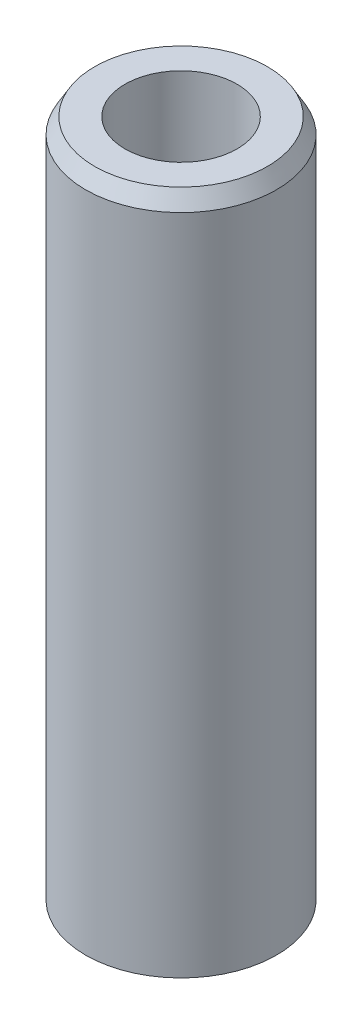
ISO-10303-21;
HEADER;
FILE_DESCRIPTION(('STEP AP214'),'2;1');
FILE_NAME('part.step','',(''),(''),'','','');
FILE_SCHEMA(('AUTOMOTIVE_DESIGN { 1 0 10303 214 1 1 1 1 }'));
ENDSEC;
DATA;
#1=APPLICATION_CONTEXT('core data for automotive mechanical design processes');
#2=APPLICATION_PROTOCOL_DEFINITION('international standard','automotive_design',2000,#1);
#3=PRODUCT_CONTEXT('',#1,'mechanical');
#4=PRODUCT('Part','Part','',(#3));
#5=PRODUCT_RELATED_PRODUCT_CATEGORY('part','',(#4));
#6=PRODUCT_DEFINITION_FORMATION('','',#4);
#7=PRODUCT_DEFINITION_CONTEXT('part definition',#1,'design');
#8=PRODUCT_DEFINITION('design','',#6,#7);
#9=PRODUCT_DEFINITION_SHAPE('','',#8);
#10=(LENGTH_UNIT() NAMED_UNIT(*) SI_UNIT(.MILLI.,.METRE.));
#11=(NAMED_UNIT(*) PLANE_ANGLE_UNIT() SI_UNIT($,.RADIAN.));
#12=(NAMED_UNIT(*) SI_UNIT($,.STERADIAN.) SOLID_ANGLE_UNIT());
#13=UNCERTAINTY_MEASURE_WITH_UNIT(LENGTH_MEASURE(1.E-05),#10,'distance_accuracy_value','');
#14=(GEOMETRIC_REPRESENTATION_CONTEXT(3) GLOBAL_UNCERTAINTY_ASSIGNED_CONTEXT((#13)) GLOBAL_UNIT_ASSIGNED_CONTEXT((#10,
#11,#12)) REPRESENTATION_CONTEXT('',''));
#15=CARTESIAN_POINT('',(0.,0.,0.));
#16=DIRECTION('',(0.,0.,1.));
#17=DIRECTION('',(1.,0.,0.));
#18=AXIS2_PLACEMENT_3D('',#15,#16,#17);
#19=CARTESIAN_POINT('',(0.,144.007816755251,0.));
#20=DIRECTION('',(0.,-1.,0.));
#21=DIRECTION('',(0.,0.,-1.));
#22=AXIS2_PLACEMENT_3D('',#19,#20,#21);
#23=CYLINDRICAL_SURFACE('',#22,20.);
#24=CARTESIAN_POINT('',(0.,140.72305377508,0.));
#25=DIRECTION('',(0.,1.,0.));
#26=DIRECTION('',(0.,0.,1.));
#27=AXIS2_PLACEMENT_3D('',#24,#25,#26);
#28=CIRCLE('',#27,20.);
#29=CARTESIAN_POINT('',(0.,140.72305377508,20.));
#30=VERTEX_POINT('',#29);
#31=EDGE_CURVE('E50',#30,#30,#28,.F.);
#32=ORIENTED_EDGE('',*,*,#31,.T.);
#33=EDGE_LOOP('',(#32));
#34=FACE_BOUND('',#33,.T.);
#35=CARTESIAN_POINT('',(0.,1.89645879082584,0.));
#36=DIRECTION('',(0.,1.,0.));
#37=DIRECTION('',(0.,0.,1.));
#38=AXIS2_PLACEMENT_3D('',#35,#36,#37);
#39=CIRCLE('',#38,20.);
#40=CARTESIAN_POINT('',(0.,1.89645879082584,20.));
#41=VERTEX_POINT('',#40);
#42=EDGE_CURVE('E51',#41,#41,#39,.T.);
#43=ORIENTED_EDGE('',*,*,#42,.T.);
#44=EDGE_LOOP('',(#43));
#45=FACE_BOUND('',#44,.T.);
#46=ADVANCED_FACE('F39',(#34,#45),#23,.T.);
#47=CARTESIAN_POINT('',(0.,144.007816755251,0.));
#48=DIRECTION('',(0.,1.,0.));
#49=DIRECTION('',(0.,0.,1.));
#50=AXIS2_PLACEMENT_3D('',#47,#48,#49);
#51=PLANE('',#50);
#52=CARTESIAN_POINT('',(0.,144.007816755251,0.));
#53=DIRECTION('',(0.,1.,0.));
#54=DIRECTION('',(0.,0.,1.));
#55=AXIS2_PLACEMENT_3D('',#52,#53,#54);
#56=CIRCLE('',#55,18.1035412091742);
#57=CARTESIAN_POINT('',(0.,144.007816755251,18.1035412091742));
#58=VERTEX_POINT('',#57);
#59=EDGE_CURVE('E54',#58,#58,#56,.T.);
#60=ORIENTED_EDGE('',*,*,#59,.T.);
#61=EDGE_LOOP('',(#60));
#62=FACE_BOUND('',#61,.T.);
#63=CARTESIAN_POINT('',(0.,144.007816755251,0.));
#64=DIRECTION('',(0.,1.,0.));
#65=DIRECTION('',(0.,0.,1.));
#66=AXIS2_PLACEMENT_3D('',#63,#64,#65);
#67=CIRCLE('',#66,11.7461129049412);
#68=CARTESIAN_POINT('',(0.,144.007816755251,11.7461129049412));
#69=VERTEX_POINT('',#68);
#70=EDGE_CURVE('E58',#69,#69,#67,.T.);
#71=ORIENTED_EDGE('',*,*,#70,.F.);
#72=EDGE_LOOP('',(#71));
#73=FACE_BOUND('',#72,.T.);
#74=ADVANCED_FACE('F69',(#62,#73),#51,.T.);
#75=CARTESIAN_POINT('',(0.,0.,0.));
#76=DIRECTION('',(0.,1.,0.));
#77=DIRECTION('',(0.,0.,1.));
#78=AXIS2_PLACEMENT_3D('',#75,#76,#77);
#79=PLANE('',#78);
#80=CARTESIAN_POINT('',(0.,0.,0.));
#81=DIRECTION('',(0.,1.,0.));
#82=DIRECTION('',(0.,0.,1.));
#83=AXIS2_PLACEMENT_3D('',#80,#81,#82);
#84=CIRCLE('',#83,16.715237019829);
#85=CARTESIAN_POINT('',(0.,0.,16.715237019829));
#86=VERTEX_POINT('',#85);
#87=EDGE_CURVE('E10',#86,#86,#84,.F.);
#88=ORIENTED_EDGE('',*,*,#87,.T.);
#89=EDGE_LOOP('',(#88));
#90=FACE_BOUND('',#89,.T.);
#91=CARTESIAN_POINT('',(0.,0.,0.));
#92=DIRECTION('',(0.,1.,0.));
#93=DIRECTION('',(0.,0.,1.));
#94=AXIS2_PLACEMENT_3D('',#91,#92,#93);
#95=CIRCLE('',#94,11.7461129049412);
#96=CARTESIAN_POINT('',(0.,0.,11.7461129049412));
#97=VERTEX_POINT('',#96);
#98=EDGE_CURVE('E63',#97,#97,#95,.T.);
#99=ORIENTED_EDGE('',*,*,#98,.T.);
#100=EDGE_LOOP('',(#99));
#101=FACE_BOUND('',#100,.T.);
#102=ADVANCED_FACE('F75',(#90,#101),#79,.F.);
#103=CARTESIAN_POINT('',(0.,144.007816755251,0.));
#104=DIRECTION('',(0.,-1.,0.));
#105=DIRECTION('',(0.,0.,-1.));
#106=AXIS2_PLACEMENT_3D('',#103,#104,#105);
#107=CYLINDRICAL_SURFACE('',#106,11.7461129049412);
#108=ORIENTED_EDGE('',*,*,#70,.T.);
#109=EDGE_LOOP('',(#108));
#110=FACE_BOUND('',#109,.T.);
#111=ORIENTED_EDGE('',*,*,#98,.F.);
#112=EDGE_LOOP('',(#111));
#113=FACE_BOUND('',#112,.T.);
#114=ADVANCED_FACE('F70',(#110,#113),#107,.F.);
#115=CARTESIAN_POINT('',(0.,144.007816755251,0.));
#116=DIRECTION('',(0.,-1.,0.));
#117=DIRECTION('',(0.,0.,-1.));
#118=AXIS2_PLACEMENT_3D('',#115,#116,#117);
#119=CONICAL_SURFACE('',#118,18.1035412091742,0.523598775598294);
#120=ORIENTED_EDGE('',*,*,#31,.F.);
#121=EDGE_LOOP('',(#120));
#122=FACE_BOUND('',#121,.T.);
#123=ORIENTED_EDGE('',*,*,#59,.F.);
#124=EDGE_LOOP('',(#123));
#125=FACE_BOUND('',#124,.T.);
#126=ADVANCED_FACE('F81',(#122,#125),#119,.T.);
#127=CARTESIAN_POINT('',(0.,1.89645879082584,0.));
#128=DIRECTION('',(0.,1.,0.));
#129=DIRECTION('',(0.,0.,1.));
#130=AXIS2_PLACEMENT_3D('',#127,#128,#129);
#131=CONICAL_SURFACE('',#130,20.,1.0471975511966);
#132=CARTESIAN_POINT('',(0.,0.,16.715237019829));
#133=CARTESIAN_POINT('',(0.,0.0197547790711022,16.7494533008724));
#134=CARTESIAN_POINT('',(0.,0.0395095581422048,16.7836695819159));
#135=CARTESIAN_POINT('',(0.,0.0790191162844097,16.8521021440028));
#136=CARTESIAN_POINT('',(0.,0.0987738953555122,16.8863184250462));
#137=CARTESIAN_POINT('',(0.,0.138283453497717,16.9547509871331));
#138=CARTESIAN_POINT('',(0.,0.15803823256882,16.9889672681766));
#139=CARTESIAN_POINT('',(0.,0.197547790711025,17.0573998302635));
#140=CARTESIAN_POINT('',(0.,0.217302569782127,17.0916161113069));
#141=CARTESIAN_POINT('',(0.,0.256812127924332,17.1600486733938));
#142=CARTESIAN_POINT('',(0.,0.276566906995435,17.1942649544373));
#143=CARTESIAN_POINT('',(0.,0.31607646513764,17.2626975165242));
#144=CARTESIAN_POINT('',(0.,0.335831244208742,17.2969137975676));
#145=CARTESIAN_POINT('',(0.,0.375340802350947,17.3653463596545));
#146=CARTESIAN_POINT('',(0.,0.395095581422049,17.399562640698));
#147=CARTESIAN_POINT('',(0.,0.434605139564255,17.4679952027848));
#148=CARTESIAN_POINT('',(0.,0.454359918635357,17.5022114838283));
#149=CARTESIAN_POINT('',(0.,0.493869476777562,17.5706440459152));
#150=CARTESIAN_POINT('',(0.,0.513624255848664,17.6048603269586));
#151=CARTESIAN_POINT('',(0.,0.553133813990869,17.6732928890455));
#152=CARTESIAN_POINT('',(0.,0.572888593061972,17.707509170089));
#153=CARTESIAN_POINT('',(0.,0.612398151204177,17.7759417321759));
#154=CARTESIAN_POINT('',(0.,0.632152930275279,17.8101580132193));
#155=CARTESIAN_POINT('',(0.,0.671662488417484,17.8785905753062));
#156=CARTESIAN_POINT('',(0.,0.691417267488587,17.9128068563497));
#157=CARTESIAN_POINT('',(0.,0.730926825630792,17.9812394184366));
#158=CARTESIAN_POINT('',(0.,0.750681604701895,18.01545569948));
#159=CARTESIAN_POINT('',(0.,0.7901911628441,18.0838882615669));
#160=CARTESIAN_POINT('',(0.,0.809945941915202,18.1181045426104));
#161=CARTESIAN_POINT('',(0.,0.849455500057407,18.1865371046973));
#162=CARTESIAN_POINT('',(0.,0.86921027912851,18.2207533857407));
#163=CARTESIAN_POINT('',(0.,0.908719837270714,18.2891859478276));
#164=CARTESIAN_POINT('',(0.,0.928474616341817,18.323402228871));
#165=CARTESIAN_POINT('',(0.,0.967984174484022,18.3918347909579));
#166=CARTESIAN_POINT('',(0.,0.987738953555125,18.4260510720014));
#167=CARTESIAN_POINT('',(0.,1.02724851169733,18.4944836340883));
#168=CARTESIAN_POINT('',(0.,1.04700329076843,18.5286999151317));
#169=CARTESIAN_POINT('',(0.,1.08651284891064,18.5971324772186));
#170=CARTESIAN_POINT('',(0.,1.10626762798174,18.6313487582621));
#171=CARTESIAN_POINT('',(0.,1.14577718612394,18.699781320349));
#172=CARTESIAN_POINT('',(0.,1.16553196519505,18.7339976013924));
#173=CARTESIAN_POINT('',(0.,1.20504152333725,18.8024301634793));
#174=CARTESIAN_POINT('',(0.,1.22479630240835,18.8366464445228));
#175=CARTESIAN_POINT('',(0.,1.26430586055056,18.9050790066097));
#176=CARTESIAN_POINT('',(0.,1.28406063962166,18.9392952876531));
#177=CARTESIAN_POINT('',(0.,1.32357019776387,19.00772784974));
#178=CARTESIAN_POINT('',(0.,1.34332497683497,19.0419441307835));
#179=CARTESIAN_POINT('',(0.,1.38283453497717,19.1103766928704));
#180=CARTESIAN_POINT('',(0.,1.40258931404828,19.1445929739138));
#181=CARTESIAN_POINT('',(0.,1.44209887219048,19.2130255360007));
#182=CARTESIAN_POINT('',(0.,1.46185365126158,19.2472418170441));
#183=CARTESIAN_POINT('',(0.,1.50136320940379,19.315674379131));
#184=CARTESIAN_POINT('',(0.,1.52111798847489,19.3498906601745));
#185=CARTESIAN_POINT('',(0.,1.5606275466171,19.4183232222614));
#186=CARTESIAN_POINT('',(0.,1.5803823256882,19.4525395033048));
#187=CARTESIAN_POINT('',(0.,1.6198918838304,19.5209720653917));
#188=CARTESIAN_POINT('',(0.,1.63964666290151,19.5551883464352));
#189=CARTESIAN_POINT('',(0.,1.67915622104371,19.6236209085221));
#190=CARTESIAN_POINT('',(0.,1.69891100011481,19.6578371895655));
#191=CARTESIAN_POINT('',(0.,1.73842055825702,19.7262697516524));
#192=CARTESIAN_POINT('',(0.,1.75817533732812,19.7604860326959));
#193=CARTESIAN_POINT('',(0.,1.79768489547033,19.8289185947828));
#194=CARTESIAN_POINT('',(0.,1.81743967454143,19.8631348758262));
#195=CARTESIAN_POINT('',(0.,1.85694923268363,19.9315674379131));
#196=CARTESIAN_POINT('',(0.,1.87670401175474,19.9657837189566));
#197=CARTESIAN_POINT('',(0.,1.89645879082584,20.));
#198=B_SPLINE_CURVE_WITH_KNOTS('',3,(#132,#133,#134,#135,#136,#137,#138,#139,#140,#141,#142,
#143,#144,#145,#146,#147,#148,#149,#150,#151,#152,#153,#154,#155,#156,#157,#158,#159,#160,#161,
#162,#163,#164,#165,#166,#167,#168,#169,#170,#171,#172,#173,#174,#175,#176,#177,#178,#179,#180,
#181,#182,#183,#184,#185,#186,#187,#188,#189,#190,#191,#192,#193,#194,#195,#196,#197),
.UNSPECIFIED.,.F.,.F.,(4,2,2,2,2,2,2,2,2,2,2,2,2,2,2,2,2,2,2,2,2,2,2,2,2,2,2,2,2,2,2,2,4),(0.,
0.118528674426615,0.23705734885323,0.355586023279845,0.47411469770646,0.592643372133075,
0.71117204655969,0.829700720986306,0.948229395412921,1.06675806983954,1.18528674426615,
1.30381541869277,1.42234409311938,1.540872767546,1.65940144197261,1.77793011639923,
1.89645879082584,2.01498746525246,2.13351613967908,2.25204481410569,2.37057348853231,
2.48910216295892,2.60763083738554,2.72615951181215,2.84468818623877,2.96321686066538,
3.081745535092,3.20027420951862,3.31880288394523,3.43733155837185,3.55586023279846,
3.67438890722507,3.79291758165169),.UNSPECIFIED.);
#199=EDGE_CURVE('BSEAM45',#86,#41,#198,.T.);
#200=ORIENTED_EDGE('',*,*,#87,.F.);
#201=ORIENTED_EDGE('',*,*,#42,.F.);
#202=ORIENTED_EDGE('',*,*,#199,.T.);
#203=ORIENTED_EDGE('',*,*,#199,.F.);
#204=EDGE_LOOP('',(#200,#202,#201,#203));
#205=FACE_BOUND('',#204,.T.);
#206=ADVANCED_FACE('F45',(#205),#131,.T.);
#207=CLOSED_SHELL('',(#46,#74,#102,#114,#126,#206));
#208=MANIFOLD_SOLID_BREP('B2',#207);
#209=ADVANCED_BREP_SHAPE_REPRESENTATION('',(#18,#208),#14);
#210=SHAPE_DEFINITION_REPRESENTATION(#9,#209);
ENDSEC;
END-ISO-10303-21;
